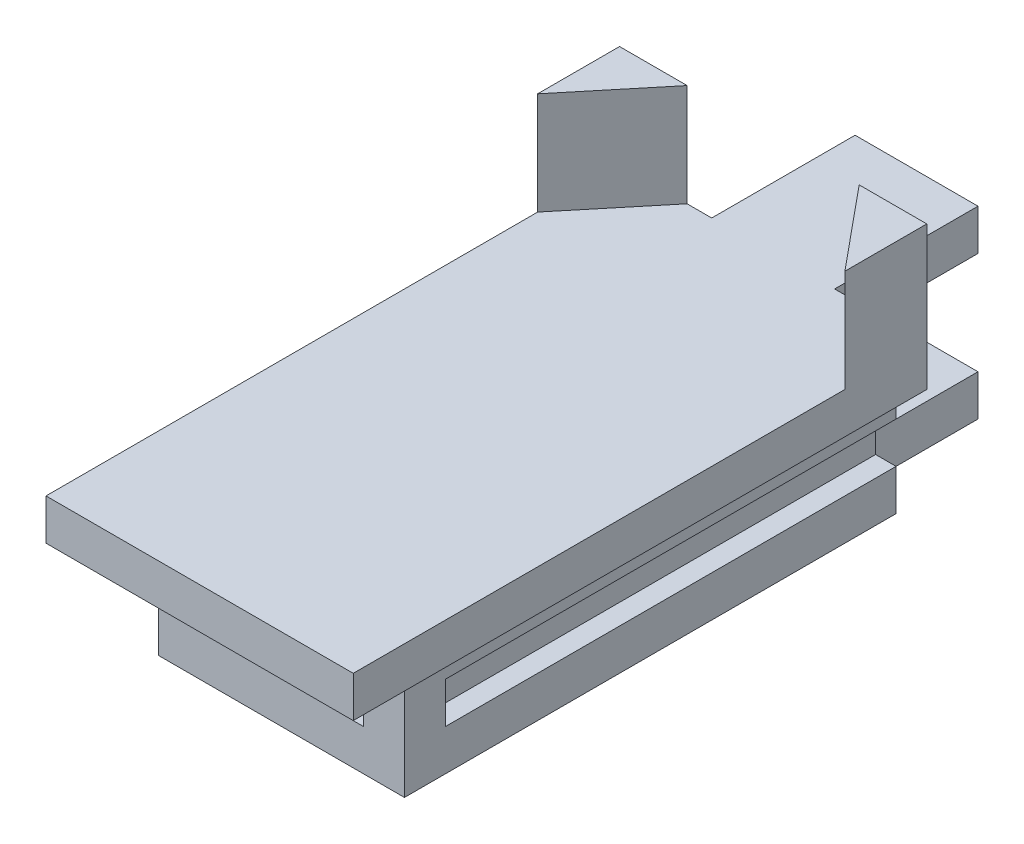
ISO-10303-21;
HEADER;
FILE_DESCRIPTION(('STEP AP214'),'2;1');
FILE_NAME('part.step','',(''),(''),'','','');
FILE_SCHEMA(('AUTOMOTIVE_DESIGN { 1 0 10303 214 1 1 1 1 }'));
ENDSEC;
DATA;
#1=APPLICATION_CONTEXT('core data for automotive mechanical design processes');
#2=APPLICATION_PROTOCOL_DEFINITION('international standard','automotive_design',2000,#1);
#3=PRODUCT_CONTEXT('',#1,'mechanical');
#4=PRODUCT('Part','Part','',(#3));
#5=PRODUCT_RELATED_PRODUCT_CATEGORY('part','',(#4));
#6=PRODUCT_DEFINITION_FORMATION('','',#4);
#7=PRODUCT_DEFINITION_CONTEXT('part definition',#1,'design');
#8=PRODUCT_DEFINITION('design','',#6,#7);
#9=PRODUCT_DEFINITION_SHAPE('','',#8);
#10=(LENGTH_UNIT() NAMED_UNIT(*) SI_UNIT(.MILLI.,.METRE.));
#11=(NAMED_UNIT(*) PLANE_ANGLE_UNIT() SI_UNIT($,.RADIAN.));
#12=(NAMED_UNIT(*) SI_UNIT($,.STERADIAN.) SOLID_ANGLE_UNIT());
#13=UNCERTAINTY_MEASURE_WITH_UNIT(LENGTH_MEASURE(1.E-05),#10,'distance_accuracy_value','');
#14=(GEOMETRIC_REPRESENTATION_CONTEXT(3) GLOBAL_UNCERTAINTY_ASSIGNED_CONTEXT((#13)) GLOBAL_UNIT_ASSIGNED_CONTEXT((#10,
#11,#12)) REPRESENTATION_CONTEXT('',''));
#15=CARTESIAN_POINT('',(0.,0.,0.));
#16=DIRECTION('',(0.,0.,1.));
#17=DIRECTION('',(1.,0.,0.));
#18=AXIS2_PLACEMENT_3D('',#15,#16,#17);
#19=CARTESIAN_POINT('',(-3.75,1.,-5.));
#20=DIRECTION('',(0.,0.,1.));
#21=DIRECTION('',(1.,0.,0.));
#22=AXIS2_PLACEMENT_3D('',#19,#20,#21);
#23=PLANE('',#22);
#24=DIRECTION('',(0.,1.,0.));
#25=VECTOR('',#24,1.);
#26=CARTESIAN_POINT('',(3.,-3.,-5.));
#27=LINE('',#26,#25);
#28=CARTESIAN_POINT('',(3.,-1.,-5.));
#29=VERTEX_POINT('',#28);
#30=CARTESIAN_POINT('',(3.,0.,-5.));
#31=VERTEX_POINT('',#30);
#32=EDGE_CURVE('E441',#29,#31,#27,.T.);
#33=ORIENTED_EDGE('',*,*,#32,.F.);
#34=DIRECTION('',(1.,0.,0.));
#35=VECTOR('',#34,1.);
#36=CARTESIAN_POINT('',(2.5,-1.,-5.));
#37=LINE('',#36,#35);
#38=CARTESIAN_POINT('',(2.5,-1.,-5.));
#39=VERTEX_POINT('',#38);
#40=EDGE_CURVE('E594',#39,#29,#37,.T.);
#41=ORIENTED_EDGE('',*,*,#40,.F.);
#42=DIRECTION('',(0.,1.,0.));
#43=VECTOR('',#42,1.);
#44=CARTESIAN_POINT('',(2.5,0.,-5.));
#45=LINE('',#44,#43);
#46=CARTESIAN_POINT('',(2.5,-2.,-5.));
#47=VERTEX_POINT('',#46);
#48=EDGE_CURVE('E606',#47,#39,#45,.T.);
#49=ORIENTED_EDGE('',*,*,#48,.F.);
#50=DIRECTION('',(1.,0.,0.));
#51=VECTOR('',#50,1.);
#52=CARTESIAN_POINT('',(2.5,-2.,-5.));
#53=LINE('',#52,#51);
#54=CARTESIAN_POINT('',(3.,-2.,-5.));
#55=VERTEX_POINT('',#54);
#56=EDGE_CURVE('E565',#47,#55,#53,.T.);
#57=ORIENTED_EDGE('',*,*,#56,.T.);
#58=CARTESIAN_POINT('',(3.,-3.,-5.));
#59=VERTEX_POINT('',#58);
#60=EDGE_CURVE('E266',#59,#55,#27,.T.);
#61=ORIENTED_EDGE('',*,*,#60,.F.);
#62=DIRECTION('',(-1.,0.,0.));
#63=VECTOR('',#62,1.);
#64=CARTESIAN_POINT('',(0.,-3.,-5.));
#65=LINE('',#64,#63);
#66=CARTESIAN_POINT('',(2.,-3.,-5.));
#67=VERTEX_POINT('',#66);
#68=EDGE_CURVE('E505',#59,#67,#65,.T.);
#69=ORIENTED_EDGE('',*,*,#68,.T.);
#70=DIRECTION('',(0.,-1.,0.));
#71=VECTOR('',#70,1.);
#72=CARTESIAN_POINT('',(2.,-2.,-5.));
#73=LINE('',#72,#71);
#74=CARTESIAN_POINT('',(2.,-2.,-5.));
#75=VERTEX_POINT('',#74);
#76=EDGE_CURVE('E544',#75,#67,#73,.T.);
#77=ORIENTED_EDGE('',*,*,#76,.F.);
#78=DIRECTION('',(0.,1.,0.));
#79=VECTOR('',#78,1.);
#80=CARTESIAN_POINT('',(2.,0.,-5.));
#81=LINE('',#80,#79);
#82=CARTESIAN_POINT('',(2.,0.,-5.));
#83=VERTEX_POINT('',#82);
#84=EDGE_CURVE('E480',#75,#83,#81,.T.);
#85=ORIENTED_EDGE('',*,*,#84,.T.);
#86=DIRECTION('',(1.,0.,0.));
#87=VECTOR('',#86,1.);
#88=CARTESIAN_POINT('',(0.,0.,-5.));
#89=LINE('',#88,#87);
#90=CARTESIAN_POINT('',(1.5,0.,-5.));
#91=VERTEX_POINT('',#90);
#92=EDGE_CURVE('E451',#91,#83,#89,.T.);
#93=ORIENTED_EDGE('',*,*,#92,.F.);
#94=DIRECTION('',(0.,-1.,0.));
#95=VECTOR('',#94,1.);
#96=CARTESIAN_POINT('',(1.5,0.,-5.));
#97=LINE('',#96,#95);
#98=CARTESIAN_POINT('',(1.5,1.,-5.));
#99=VERTEX_POINT('',#98);
#100=EDGE_CURVE('E272',#99,#91,#97,.T.);
#101=ORIENTED_EDGE('',*,*,#100,.F.);
#102=DIRECTION('',(-1.,0.,0.));
#103=VECTOR('',#102,1.);
#104=CARTESIAN_POINT('',(-3.75,1.,-5.));
#105=LINE('',#104,#103);
#106=CARTESIAN_POINT('',(2.1,1.,-5.));
#107=VERTEX_POINT('',#106);
#108=EDGE_CURVE('E339',#107,#99,#105,.T.);
#109=ORIENTED_EDGE('',*,*,#108,.F.);
#110=DIRECTION('',(0.,-1.,0.));
#111=VECTOR('',#110,1.);
#112=CARTESIAN_POINT('',(2.1,3.5,-5.));
#113=LINE('',#112,#111);
#114=CARTESIAN_POINT('',(2.1,3.5,-5.));
#115=VERTEX_POINT('',#114);
#116=EDGE_CURVE('E309',#115,#107,#113,.T.);
#117=ORIENTED_EDGE('',*,*,#116,.F.);
#118=DIRECTION('',(-1.,0.,0.));
#119=VECTOR('',#118,1.);
#120=CARTESIAN_POINT('',(0.,3.5,-5.));
#121=LINE('',#120,#119);
#122=CARTESIAN_POINT('',(3.75,3.5,-5.));
#123=VERTEX_POINT('',#122);
#124=EDGE_CURVE('E296',#123,#115,#121,.T.);
#125=ORIENTED_EDGE('',*,*,#124,.F.);
#126=DIRECTION('',(0.,-1.,0.));
#127=VECTOR('',#126,1.);
#128=CARTESIAN_POINT('',(3.75,1.,-5.));
#129=LINE('',#128,#127);
#130=CARTESIAN_POINT('',(3.75,0.,-5.));
#131=VERTEX_POINT('',#130);
#132=EDGE_CURVE('E11',#123,#131,#129,.T.);
#133=ORIENTED_EDGE('',*,*,#132,.T.);
#134=DIRECTION('',(-1.,0.,0.));
#135=VECTOR('',#134,1.);
#136=CARTESIAN_POINT('',(-3.75,0.,-5.));
#137=LINE('',#136,#135);
#138=EDGE_CURVE('E348',#131,#31,#137,.T.);
#139=ORIENTED_EDGE('',*,*,#138,.T.);
#140=EDGE_LOOP('',(#33,#41,#49,#57,#61,#69,#77,#85,#93,#101,#109,#117,#125,#133,#139));
#141=FACE_BOUND('',#140,.T.);
#142=ADVANCED_FACE('F38',(#141),#23,.F.);
#143=DIRECTION('',(0.,1.,0.));
#144=VECTOR('',#143,1.);
#145=CARTESIAN_POINT('',(-3.,-3.,-5.));
#146=LINE('',#145,#144);
#147=CARTESIAN_POINT('',(-3.,-3.,-5.));
#148=VERTEX_POINT('',#147);
#149=CARTESIAN_POINT('',(-3.,-2.,-5.));
#150=VERTEX_POINT('',#149);
#151=EDGE_CURVE('E462',#148,#150,#146,.T.);
#152=ORIENTED_EDGE('',*,*,#151,.T.);
#153=DIRECTION('',(-1.,0.,0.));
#154=VECTOR('',#153,1.);
#155=CARTESIAN_POINT('',(-2.5,-2.,-5.));
#156=LINE('',#155,#154);
#157=CARTESIAN_POINT('',(-2.5,-2.,-5.));
#158=VERTEX_POINT('',#157);
#159=EDGE_CURVE('E615',#158,#150,#156,.T.);
#160=ORIENTED_EDGE('',*,*,#159,.F.);
#161=DIRECTION('',(0.,-1.,0.));
#162=VECTOR('',#161,1.);
#163=CARTESIAN_POINT('',(-2.5,0.,-5.));
#164=LINE('',#163,#162);
#165=CARTESIAN_POINT('',(-2.5,-1.,-5.));
#166=VERTEX_POINT('',#165);
#167=EDGE_CURVE('E627',#166,#158,#164,.T.);
#168=ORIENTED_EDGE('',*,*,#167,.F.);
#169=DIRECTION('',(-1.,0.,0.));
#170=VECTOR('',#169,1.);
#171=CARTESIAN_POINT('',(-2.5,-1.,-5.));
#172=LINE('',#171,#170);
#173=CARTESIAN_POINT('',(-3.,-1.,-5.));
#174=VERTEX_POINT('',#173);
#175=EDGE_CURVE('E520',#166,#174,#172,.T.);
#176=ORIENTED_EDGE('',*,*,#175,.T.);
#177=CARTESIAN_POINT('',(-3.,0.,-5.));
#178=VERTEX_POINT('',#177);
#179=EDGE_CURVE('E465',#174,#178,#146,.T.);
#180=ORIENTED_EDGE('',*,*,#179,.T.);
#181=CARTESIAN_POINT('',(-3.75,0.,-5.));
#182=VERTEX_POINT('',#181);
#183=EDGE_CURVE('E347',#178,#182,#137,.T.);
#184=ORIENTED_EDGE('',*,*,#183,.T.);
#185=DIRECTION('',(0.,-1.,0.));
#186=VECTOR('',#185,1.);
#187=CARTESIAN_POINT('',(-3.75,1.,-5.));
#188=LINE('',#187,#186);
#189=CARTESIAN_POINT('',(-3.75,3.5,-5.));
#190=VERTEX_POINT('',#189);
#191=EDGE_CURVE('E48',#190,#182,#188,.T.);
#192=ORIENTED_EDGE('',*,*,#191,.F.);
#193=DIRECTION('',(-1.,0.,0.));
#194=VECTOR('',#193,1.);
#195=CARTESIAN_POINT('',(0.,3.5,-5.));
#196=LINE('',#195,#194);
#197=CARTESIAN_POINT('',(-2.1,3.5,-5.));
#198=VERTEX_POINT('',#197);
#199=EDGE_CURVE('E316',#198,#190,#196,.T.);
#200=ORIENTED_EDGE('',*,*,#199,.F.);
#201=DIRECTION('',(0.,-1.,0.));
#202=VECTOR('',#201,1.);
#203=CARTESIAN_POINT('',(-2.1,3.5,-5.));
#204=LINE('',#203,#202);
#205=CARTESIAN_POINT('',(-2.1,1.,-5.));
#206=VERTEX_POINT('',#205);
#207=EDGE_CURVE('E332',#198,#206,#204,.T.);
#208=ORIENTED_EDGE('',*,*,#207,.T.);
#209=CARTESIAN_POINT('',(-1.5,1.,-5.));
#210=VERTEX_POINT('',#209);
#211=EDGE_CURVE('E42',#210,#206,#105,.T.);
#212=ORIENTED_EDGE('',*,*,#211,.F.);
#213=DIRECTION('',(0.,1.,0.));
#214=VECTOR('',#213,1.);
#215=CARTESIAN_POINT('',(-1.5,0.,-5.));
#216=LINE('',#215,#214);
#217=CARTESIAN_POINT('',(-1.5,0.,-5.));
#218=VERTEX_POINT('',#217);
#219=EDGE_CURVE('E277',#218,#210,#216,.T.);
#220=ORIENTED_EDGE('',*,*,#219,.F.);
#221=CARTESIAN_POINT('',(-2.,0.,-5.));
#222=VERTEX_POINT('',#221);
#223=EDGE_CURVE('E270',#222,#218,#89,.T.);
#224=ORIENTED_EDGE('',*,*,#223,.F.);
#225=DIRECTION('',(0.,1.,0.));
#226=VECTOR('',#225,1.);
#227=CARTESIAN_POINT('',(-2.,0.,-5.));
#228=LINE('',#227,#226);
#229=CARTESIAN_POINT('',(-2.,-2.,-5.));
#230=VERTEX_POINT('',#229);
#231=EDGE_CURVE('E474',#230,#222,#228,.T.);
#232=ORIENTED_EDGE('',*,*,#231,.F.);
#233=DIRECTION('',(0.,1.,0.));
#234=VECTOR('',#233,1.);
#235=CARTESIAN_POINT('',(-2.,-2.,-5.));
#236=LINE('',#235,#234);
#237=CARTESIAN_POINT('',(-2.,-3.,-5.));
#238=VERTEX_POINT('',#237);
#239=EDGE_CURVE('E476',#238,#230,#236,.T.);
#240=ORIENTED_EDGE('',*,*,#239,.F.);
#241=EDGE_CURVE('E461',#238,#148,#65,.T.);
#242=ORIENTED_EDGE('',*,*,#241,.T.);
#243=EDGE_LOOP('',(#152,#160,#168,#176,#180,#184,#192,#200,#208,#212,#220,#224,#232,#240,#242));
#244=FACE_BOUND('',#243,.T.);
#245=ADVANCED_FACE('F378',(#244),#23,.F.);
#246=CARTESIAN_POINT('',(0.,-3.,7.));
#247=DIRECTION('',(0.,0.,1.));
#248=DIRECTION('',(1.,0.,0.));
#249=AXIS2_PLACEMENT_3D('',#246,#247,#248);
#250=PLANE('',#249);
#251=DIRECTION('',(1.,0.,0.));
#252=VECTOR('',#251,1.);
#253=CARTESIAN_POINT('',(0.,0.,7.));
#254=LINE('',#253,#252);
#255=CARTESIAN_POINT('',(2.,0.,7.));
#256=VERTEX_POINT('',#255);
#257=CARTESIAN_POINT('',(3.,0.,7.));
#258=VERTEX_POINT('',#257);
#259=EDGE_CURVE('E446',#256,#258,#254,.T.);
#260=ORIENTED_EDGE('',*,*,#259,.F.);
#261=DIRECTION('',(0.,-1.,0.));
#262=VECTOR('',#261,1.);
#263=CARTESIAN_POINT('',(2.,0.,7.));
#264=LINE('',#263,#262);
#265=CARTESIAN_POINT('',(2.,-2.,7.));
#266=VERTEX_POINT('',#265);
#267=EDGE_CURVE('E491',#256,#266,#264,.T.);
#268=ORIENTED_EDGE('',*,*,#267,.T.);
#269=DIRECTION('',(1.,0.,0.));
#270=VECTOR('',#269,1.);
#271=CARTESIAN_POINT('',(0.,-2.,7.));
#272=LINE('',#271,#270);
#273=CARTESIAN_POINT('',(-2.,-2.,7.));
#274=VERTEX_POINT('',#273);
#275=EDGE_CURVE('E497',#274,#266,#272,.T.);
#276=ORIENTED_EDGE('',*,*,#275,.F.);
#277=DIRECTION('',(0.,-1.,0.));
#278=VECTOR('',#277,1.);
#279=CARTESIAN_POINT('',(-2.,0.,7.));
#280=LINE('',#279,#278);
#281=CARTESIAN_POINT('',(-2.,0.,7.));
#282=VERTEX_POINT('',#281);
#283=EDGE_CURVE('E494',#282,#274,#280,.T.);
#284=ORIENTED_EDGE('',*,*,#283,.F.);
#285=CARTESIAN_POINT('',(-3.,0.,7.));
#286=VERTEX_POINT('',#285);
#287=EDGE_CURVE('E449',#286,#282,#254,.T.);
#288=ORIENTED_EDGE('',*,*,#287,.F.);
#289=DIRECTION('',(0.,1.,0.));
#290=VECTOR('',#289,1.);
#291=CARTESIAN_POINT('',(-3.,-3.,7.));
#292=LINE('',#291,#290);
#293=CARTESIAN_POINT('',(-3.,-3.,7.));
#294=VERTEX_POINT('',#293);
#295=EDGE_CURVE('E464',#294,#286,#292,.T.);
#296=ORIENTED_EDGE('',*,*,#295,.F.);
#297=DIRECTION('',(1.,0.,0.));
#298=VECTOR('',#297,1.);
#299=CARTESIAN_POINT('',(0.,-3.,7.));
#300=LINE('',#299,#298);
#301=CARTESIAN_POINT('',(3.,-3.,7.));
#302=VERTEX_POINT('',#301);
#303=EDGE_CURVE('E510',#294,#302,#300,.T.);
#304=ORIENTED_EDGE('',*,*,#303,.T.);
#305=DIRECTION('',(0.,1.,0.));
#306=VECTOR('',#305,1.);
#307=CARTESIAN_POINT('',(3.,-3.,7.));
#308=LINE('',#307,#306);
#309=EDGE_CURVE('E467',#302,#258,#308,.T.);
#310=ORIENTED_EDGE('',*,*,#309,.T.);
#311=EDGE_LOOP('',(#260,#268,#276,#284,#288,#296,#304,#310));
#312=FACE_BOUND('',#311,.T.);
#313=ADVANCED_FACE('F400',(#312),#250,.T.);
#314=CARTESIAN_POINT('',(0.,1.,0.));
#315=DIRECTION('',(0.,-1.,0.));
#316=DIRECTION('',(0.,0.,-1.));
#317=AXIS2_PLACEMENT_3D('',#314,#315,#316);
#318=PLANE('',#317);
#319=DIRECTION('',(0.,0.,1.));
#320=VECTOR('',#319,1.);
#321=CARTESIAN_POINT('',(1.5,1.,-10.));
#322=LINE('',#321,#320);
#323=CARTESIAN_POINT('',(1.5,1.,-8.5));
#324=VERTEX_POINT('',#323);
#325=EDGE_CURVE('E274',#324,#99,#322,.T.);
#326=ORIENTED_EDGE('',*,*,#325,.F.);
#327=DIRECTION('',(-1.,0.,0.));
#328=VECTOR('',#327,1.);
#329=CARTESIAN_POINT('',(0.,1.,-8.5));
#330=LINE('',#329,#328);
#331=CARTESIAN_POINT('',(-1.5,1.,-8.5));
#332=VERTEX_POINT('',#331);
#333=EDGE_CURVE('E256',#324,#332,#330,.T.);
#334=ORIENTED_EDGE('',*,*,#333,.T.);
#335=DIRECTION('',(0.,0.,1.));
#336=VECTOR('',#335,1.);
#337=CARTESIAN_POINT('',(-1.5,1.,-10.));
#338=LINE('',#337,#336);
#339=EDGE_CURVE('E265',#332,#210,#338,.T.);
#340=ORIENTED_EDGE('',*,*,#339,.T.);
#341=ORIENTED_EDGE('',*,*,#211,.T.);
#342=DIRECTION('',(-0.636382954795564,0.,0.771373278540077));
#343=VECTOR('',#342,1.);
#344=CARTESIAN_POINT('',(-3.70397917441428,1.,-3.05578281889178));
#345=LINE('',#344,#343);
#346=CARTESIAN_POINT('',(-3.75,1.,-2.99999999999999));
#347=VERTEX_POINT('',#346);
#348=EDGE_CURVE('E312',#206,#347,#345,.T.);
#349=ORIENTED_EDGE('',*,*,#348,.T.);
#350=DIRECTION('',(0.,0.,1.));
#351=VECTOR('',#350,1.);
#352=CARTESIAN_POINT('',(-3.75,1.,5.));
#353=LINE('',#352,#351);
#354=CARTESIAN_POINT('',(-3.75,1.,9.));
#355=VERTEX_POINT('',#354);
#356=EDGE_CURVE('E329',#347,#355,#353,.T.);
#357=ORIENTED_EDGE('',*,*,#356,.T.);
#358=DIRECTION('',(-1.,0.,0.));
#359=VECTOR('',#358,1.);
#360=CARTESIAN_POINT('',(-3.75,1.,9.));
#361=LINE('',#360,#359);
#362=CARTESIAN_POINT('',(3.75,1.,9.));
#363=VERTEX_POINT('',#362);
#364=EDGE_CURVE('E292',#363,#355,#361,.T.);
#365=ORIENTED_EDGE('',*,*,#364,.F.);
#366=DIRECTION('',(0.,0.,-1.));
#367=VECTOR('',#366,1.);
#368=CARTESIAN_POINT('',(3.75,1.,5.));
#369=LINE('',#368,#367);
#370=CARTESIAN_POINT('',(3.75,1.,-3.));
#371=VERTEX_POINT('',#370);
#372=EDGE_CURVE('E324',#363,#371,#369,.T.);
#373=ORIENTED_EDGE('',*,*,#372,.T.);
#374=DIRECTION('',(0.636382954795564,0.,0.771373278540077));
#375=VECTOR('',#374,1.);
#376=CARTESIAN_POINT('',(3.70397917441428,1.,-3.05578281889178));
#377=LINE('',#376,#375);
#378=EDGE_CURVE('E295',#107,#371,#377,.T.);
#379=ORIENTED_EDGE('',*,*,#378,.F.);
#380=ORIENTED_EDGE('',*,*,#108,.T.);
#381=EDGE_LOOP('',(#326,#334,#340,#341,#349,#357,#365,#373,#379,#380));
#382=FACE_BOUND('',#381,.T.);
#383=ADVANCED_FACE('F361',(#382),#318,.F.);
#384=CARTESIAN_POINT('',(-1.5,0.,-10.));
#385=DIRECTION('',(1.,0.,0.));
#386=DIRECTION('',(0.,1.,0.));
#387=AXIS2_PLACEMENT_3D('',#384,#385,#386);
#388=PLANE('',#387);
#389=DIRECTION('',(0.,1.,0.));
#390=VECTOR('',#389,1.);
#391=CARTESIAN_POINT('',(-1.5,0.,-8.5));
#392=LINE('',#391,#390);
#393=CARTESIAN_POINT('',(-1.5,0.,-8.5));
#394=VERTEX_POINT('',#393);
#395=EDGE_CURVE('E248',#394,#332,#392,.T.);
#396=ORIENTED_EDGE('',*,*,#395,.F.);
#397=DIRECTION('',(0.,0.,1.));
#398=VECTOR('',#397,1.);
#399=CARTESIAN_POINT('',(-1.5,0.,-10.));
#400=LINE('',#399,#398);
#401=EDGE_CURVE('E263',#394,#218,#400,.T.);
#402=ORIENTED_EDGE('',*,*,#401,.T.);
#403=ORIENTED_EDGE('',*,*,#219,.T.);
#404=ORIENTED_EDGE('',*,*,#339,.F.);
#405=EDGE_LOOP('',(#396,#402,#403,#404));
#406=FACE_BOUND('',#405,.T.);
#407=ADVANCED_FACE('F261',(#406),#388,.F.);
#408=CARTESIAN_POINT('',(1.5,0.,-10.));
#409=DIRECTION('',(-1.,0.,0.));
#410=DIRECTION('',(0.,-1.,0.));
#411=AXIS2_PLACEMENT_3D('',#408,#409,#410);
#412=PLANE('',#411);
#413=DIRECTION('',(0.,-1.,0.));
#414=VECTOR('',#413,1.);
#415=CARTESIAN_POINT('',(1.5,0.,-8.5));
#416=LINE('',#415,#414);
#417=CARTESIAN_POINT('',(1.5,0.,-8.5));
#418=VERTEX_POINT('',#417);
#419=EDGE_CURVE('E251',#324,#418,#416,.T.);
#420=ORIENTED_EDGE('',*,*,#419,.F.);
#421=ORIENTED_EDGE('',*,*,#325,.T.);
#422=ORIENTED_EDGE('',*,*,#100,.T.);
#423=DIRECTION('',(0.,0.,1.));
#424=VECTOR('',#423,1.);
#425=CARTESIAN_POINT('',(1.5,0.,-10.));
#426=LINE('',#425,#424);
#427=EDGE_CURVE('E271',#418,#91,#426,.T.);
#428=ORIENTED_EDGE('',*,*,#427,.F.);
#429=EDGE_LOOP('',(#420,#421,#422,#428));
#430=FACE_BOUND('',#429,.T.);
#431=ADVANCED_FACE('F412',(#430),#412,.F.);
#432=CARTESIAN_POINT('',(3.75,1.,5.));
#433=DIRECTION('',(-1.,0.,0.));
#434=DIRECTION('',(0.,0.,1.));
#435=AXIS2_PLACEMENT_3D('',#432,#433,#434);
#436=PLANE('',#435);
#437=DIRECTION('',(0.,0.,-1.));
#438=VECTOR('',#437,1.);
#439=CARTESIAN_POINT('',(3.75,0.,5.));
#440=LINE('',#439,#438);
#441=CARTESIAN_POINT('',(3.75,0.,9.));
#442=VERTEX_POINT('',#441);
#443=EDGE_CURVE('E337',#442,#131,#440,.T.);
#444=ORIENTED_EDGE('',*,*,#443,.T.);
#445=ORIENTED_EDGE('',*,*,#132,.F.);
#446=DIRECTION('',(0.,0.,-1.));
#447=VECTOR('',#446,1.);
#448=CARTESIAN_POINT('',(3.75,3.5,0.));
#449=LINE('',#448,#447);
#450=CARTESIAN_POINT('',(3.75,3.5,-3.));
#451=VERTEX_POINT('',#450);
#452=EDGE_CURVE('E301',#451,#123,#449,.T.);
#453=ORIENTED_EDGE('',*,*,#452,.F.);
#454=DIRECTION('',(0.,-1.,0.));
#455=VECTOR('',#454,1.);
#456=CARTESIAN_POINT('',(3.75,3.5,-3.));
#457=LINE('',#456,#455);
#458=EDGE_CURVE('E304',#451,#371,#457,.T.);
#459=ORIENTED_EDGE('',*,*,#458,.T.);
#460=ORIENTED_EDGE('',*,*,#372,.F.);
#461=DIRECTION('',(0.,1.,0.));
#462=VECTOR('',#461,1.);
#463=CARTESIAN_POINT('',(3.75,1.,9.));
#464=LINE('',#463,#462);
#465=EDGE_CURVE('E289',#442,#363,#464,.T.);
#466=ORIENTED_EDGE('',*,*,#465,.F.);
#467=EDGE_LOOP('',(#444,#445,#453,#459,#460,#466));
#468=FACE_BOUND('',#467,.T.);
#469=ADVANCED_FACE('F40',(#468),#436,.F.);
#470=CARTESIAN_POINT('',(-3.75,1.,5.));
#471=DIRECTION('',(1.,0.,0.));
#472=DIRECTION('',(0.,0.,-1.));
#473=AXIS2_PLACEMENT_3D('',#470,#471,#472);
#474=PLANE('',#473);
#475=DIRECTION('',(0.,0.,1.));
#476=VECTOR('',#475,1.);
#477=CARTESIAN_POINT('',(-3.75,0.,5.));
#478=LINE('',#477,#476);
#479=CARTESIAN_POINT('',(-3.75,0.,9.));
#480=VERTEX_POINT('',#479);
#481=EDGE_CURVE('E351',#182,#480,#478,.T.);
#482=ORIENTED_EDGE('',*,*,#481,.T.);
#483=DIRECTION('',(0.,-1.,0.));
#484=VECTOR('',#483,1.);
#485=CARTESIAN_POINT('',(-3.75,1.,9.));
#486=LINE('',#485,#484);
#487=EDGE_CURVE('E283',#355,#480,#486,.T.);
#488=ORIENTED_EDGE('',*,*,#487,.F.);
#489=ORIENTED_EDGE('',*,*,#356,.F.);
#490=DIRECTION('',(0.,-1.,0.));
#491=VECTOR('',#490,1.);
#492=CARTESIAN_POINT('',(-3.75,3.5,-3.));
#493=LINE('',#492,#491);
#494=CARTESIAN_POINT('',(-3.75,3.5,-3.));
#495=VERTEX_POINT('',#494);
#496=EDGE_CURVE('E321',#495,#347,#493,.T.);
#497=ORIENTED_EDGE('',*,*,#496,.F.);
#498=DIRECTION('',(0.,0.,1.));
#499=VECTOR('',#498,1.);
#500=CARTESIAN_POINT('',(-3.75,3.5,0.));
#501=LINE('',#500,#499);
#502=EDGE_CURVE('E319',#190,#495,#501,.T.);
#503=ORIENTED_EDGE('',*,*,#502,.F.);
#504=ORIENTED_EDGE('',*,*,#191,.T.);
#505=EDGE_LOOP('',(#482,#488,#489,#497,#503,#504));
#506=FACE_BOUND('',#505,.T.);
#507=ADVANCED_FACE('F368',(#506),#474,.F.);
#508=CARTESIAN_POINT('',(0.,0.,0.));
#509=DIRECTION('',(0.,-1.,0.));
#510=DIRECTION('',(0.,0.,-1.));
#511=AXIS2_PLACEMENT_3D('',#508,#509,#510);
#512=PLANE('',#511);
#513=DIRECTION('',(-1.,0.,0.));
#514=VECTOR('',#513,1.);
#515=CARTESIAN_POINT('',(-3.5,0.,-8.5));
#516=LINE('',#515,#514);
#517=EDGE_CURVE('E245',#418,#394,#516,.T.);
#518=ORIENTED_EDGE('',*,*,#517,.F.);
#519=ORIENTED_EDGE('',*,*,#427,.T.);
#520=ORIENTED_EDGE('',*,*,#92,.T.);
#521=DIRECTION('',(0.,0.,1.));
#522=VECTOR('',#521,1.);
#523=CARTESIAN_POINT('',(2.,0.,-9.47213595499958));
#524=LINE('',#523,#522);
#525=EDGE_CURVE('E499',#83,#256,#524,.T.);
#526=ORIENTED_EDGE('',*,*,#525,.T.);
#527=ORIENTED_EDGE('',*,*,#259,.T.);
#528=DIRECTION('',(0.,0.,-1.));
#529=VECTOR('',#528,1.);
#530=CARTESIAN_POINT('',(3.,0.,0.));
#531=LINE('',#530,#529);
#532=EDGE_CURVE('E444',#258,#31,#531,.T.);
#533=ORIENTED_EDGE('',*,*,#532,.T.);
#534=ORIENTED_EDGE('',*,*,#138,.F.);
#535=ORIENTED_EDGE('',*,*,#443,.F.);
#536=DIRECTION('',(1.,0.,0.));
#537=VECTOR('',#536,1.);
#538=CARTESIAN_POINT('',(-3.75,0.,9.));
#539=LINE('',#538,#537);
#540=EDGE_CURVE('E286',#480,#442,#539,.T.);
#541=ORIENTED_EDGE('',*,*,#540,.F.);
#542=ORIENTED_EDGE('',*,*,#481,.F.);
#543=ORIENTED_EDGE('',*,*,#183,.F.);
#544=DIRECTION('',(0.,0.,-1.));
#545=VECTOR('',#544,1.);
#546=CARTESIAN_POINT('',(-3.,0.,0.));
#547=LINE('',#546,#545);
#548=EDGE_CURVE('E458',#286,#178,#547,.T.);
#549=ORIENTED_EDGE('',*,*,#548,.F.);
#550=ORIENTED_EDGE('',*,*,#287,.T.);
#551=DIRECTION('',(0.,0.,1.));
#552=VECTOR('',#551,1.);
#553=CARTESIAN_POINT('',(-2.,0.,-9.47213595499958));
#554=LINE('',#553,#552);
#555=EDGE_CURVE('E502',#222,#282,#554,.T.);
#556=ORIENTED_EDGE('',*,*,#555,.F.);
#557=ORIENTED_EDGE('',*,*,#223,.T.);
#558=ORIENTED_EDGE('',*,*,#401,.F.);
#559=EDGE_LOOP('',(#518,#519,#520,#526,#527,#533,#534,#535,#541,#542,#543,#549,#550,#556,#557,#558));
#560=FACE_BOUND('',#559,.T.);
#561=ADVANCED_FACE('F268',(#560),#512,.T.);
#562=CARTESIAN_POINT('',(-3.70397917441428,3.5,-3.05578281889178));
#563=DIRECTION('',(0.771373278540077,0.,0.636382954795564));
#564=DIRECTION('',(0.636382954795564,0.,-0.771373278540077));
#565=AXIS2_PLACEMENT_3D('',#562,#563,#564);
#566=PLANE('',#565);
#567=ORIENTED_EDGE('',*,*,#348,.F.);
#568=ORIENTED_EDGE('',*,*,#207,.F.);
#569=DIRECTION('',(-0.636382954795564,0.,0.771373278540077));
#570=VECTOR('',#569,1.);
#571=CARTESIAN_POINT('',(-3.70397917441428,3.5,-3.05578281889178));
#572=LINE('',#571,#570);
#573=EDGE_CURVE('E313',#198,#495,#572,.T.);
#574=ORIENTED_EDGE('',*,*,#573,.T.);
#575=ORIENTED_EDGE('',*,*,#496,.T.);
#576=EDGE_LOOP('',(#567,#568,#574,#575));
#577=FACE_BOUND('',#576,.T.);
#578=ADVANCED_FACE('F381',(#577),#566,.T.);
#579=CARTESIAN_POINT('',(0.,3.5,0.));
#580=DIRECTION('',(0.,1.,0.));
#581=DIRECTION('',(0.,0.,1.));
#582=AXIS2_PLACEMENT_3D('',#579,#580,#581);
#583=PLANE('',#582);
#584=ORIENTED_EDGE('',*,*,#573,.F.);
#585=ORIENTED_EDGE('',*,*,#199,.T.);
#586=ORIENTED_EDGE('',*,*,#502,.T.);
#587=EDGE_LOOP('',(#584,#585,#586));
#588=FACE_BOUND('',#587,.T.);
#589=ADVANCED_FACE('F383',(#588),#583,.T.);
#590=CARTESIAN_POINT('',(3.70397917441428,3.5,-3.05578281889178));
#591=DIRECTION('',(0.771373278540077,0.,-0.636382954795564));
#592=DIRECTION('',(-0.636382954795564,0.,-0.771373278540077));
#593=AXIS2_PLACEMENT_3D('',#590,#591,#592);
#594=PLANE('',#593);
#595=ORIENTED_EDGE('',*,*,#378,.T.);
#596=ORIENTED_EDGE('',*,*,#458,.F.);
#597=DIRECTION('',(0.636382954795564,0.,0.771373278540077));
#598=VECTOR('',#597,1.);
#599=CARTESIAN_POINT('',(3.70397917441428,3.5,-3.05578281889178));
#600=LINE('',#599,#598);
#601=EDGE_CURVE('E299',#115,#451,#600,.T.);
#602=ORIENTED_EDGE('',*,*,#601,.F.);
#603=ORIENTED_EDGE('',*,*,#116,.T.);
#604=EDGE_LOOP('',(#595,#596,#602,#603));
#605=FACE_BOUND('',#604,.T.);
#606=ADVANCED_FACE('F385',(#605),#594,.F.);
#607=CARTESIAN_POINT('',(0.,3.5,0.));
#608=DIRECTION('',(0.,1.,0.));
#609=DIRECTION('',(0.,0.,1.));
#610=AXIS2_PLACEMENT_3D('',#607,#608,#609);
#611=PLANE('',#610);
#612=ORIENTED_EDGE('',*,*,#124,.T.);
#613=ORIENTED_EDGE('',*,*,#601,.T.);
#614=ORIENTED_EDGE('',*,*,#452,.T.);
#615=EDGE_LOOP('',(#612,#613,#614));
#616=FACE_BOUND('',#615,.T.);
#617=ADVANCED_FACE('F391',(#616),#611,.T.);
#618=CARTESIAN_POINT('',(0.,0.,9.));
#619=DIRECTION('',(0.,0.,1.));
#620=DIRECTION('',(1.,0.,0.));
#621=AXIS2_PLACEMENT_3D('',#618,#619,#620);
#622=PLANE('',#621);
#623=ORIENTED_EDGE('',*,*,#487,.T.);
#624=ORIENTED_EDGE('',*,*,#540,.T.);
#625=ORIENTED_EDGE('',*,*,#465,.T.);
#626=ORIENTED_EDGE('',*,*,#364,.T.);
#627=EDGE_LOOP('',(#623,#624,#625,#626));
#628=FACE_BOUND('',#627,.T.);
#629=ADVANCED_FACE('F366',(#628),#622,.T.);
#630=CARTESIAN_POINT('',(3.,-3.,0.));
#631=DIRECTION('',(1.,0.,0.));
#632=DIRECTION('',(0.,0.,-1.));
#633=AXIS2_PLACEMENT_3D('',#630,#631,#632);
#634=PLANE('',#633);
#635=DIRECTION('',(0.,0.,1.));
#636=VECTOR('',#635,1.);
#637=CARTESIAN_POINT('',(3.,-1.,0.));
#638=LINE('',#637,#636);
#639=CARTESIAN_POINT('',(3.,-1.,6.));
#640=VERTEX_POINT('',#639);
#641=EDGE_CURVE('E597',#29,#640,#638,.T.);
#642=ORIENTED_EDGE('',*,*,#641,.F.);
#643=ORIENTED_EDGE('',*,*,#32,.T.);
#644=ORIENTED_EDGE('',*,*,#532,.F.);
#645=ORIENTED_EDGE('',*,*,#309,.F.);
#646=DIRECTION('',(0.,0.,-1.));
#647=VECTOR('',#646,1.);
#648=CARTESIAN_POINT('',(3.,-3.,0.));
#649=LINE('',#648,#647);
#650=EDGE_CURVE('E508',#302,#59,#649,.T.);
#651=ORIENTED_EDGE('',*,*,#650,.T.);
#652=ORIENTED_EDGE('',*,*,#60,.T.);
#653=DIRECTION('',(0.,0.,1.));
#654=VECTOR('',#653,1.);
#655=CARTESIAN_POINT('',(3.,-2.,0.));
#656=LINE('',#655,#654);
#657=CARTESIAN_POINT('',(3.,-2.,6.));
#658=VERTEX_POINT('',#657);
#659=EDGE_CURVE('E568',#55,#658,#656,.T.);
#660=ORIENTED_EDGE('',*,*,#659,.T.);
#661=DIRECTION('',(0.,1.,0.));
#662=VECTOR('',#661,1.);
#663=CARTESIAN_POINT('',(3.,0.,6.));
#664=LINE('',#663,#662);
#665=EDGE_CURVE('E64',#658,#640,#664,.T.);
#666=ORIENTED_EDGE('',*,*,#665,.T.);
#667=EDGE_LOOP('',(#642,#643,#644,#645,#651,#652,#660,#666));
#668=FACE_BOUND('',#667,.T.);
#669=ADVANCED_FACE('F423',(#668),#634,.T.);
#670=CARTESIAN_POINT('',(-3.,-3.,0.));
#671=DIRECTION('',(1.,0.,0.));
#672=DIRECTION('',(0.,0.,-1.));
#673=AXIS2_PLACEMENT_3D('',#670,#671,#672);
#674=PLANE('',#673);
#675=DIRECTION('',(0.,-1.,0.));
#676=VECTOR('',#675,1.);
#677=CARTESIAN_POINT('',(-3.,0.,6.));
#678=LINE('',#677,#676);
#679=CARTESIAN_POINT('',(-3.,-1.,6.));
#680=VERTEX_POINT('',#679);
#681=CARTESIAN_POINT('',(-3.,-2.,6.));
#682=VERTEX_POINT('',#681);
#683=EDGE_CURVE('E56',#680,#682,#678,.T.);
#684=ORIENTED_EDGE('',*,*,#683,.T.);
#685=DIRECTION('',(0.,0.,1.));
#686=VECTOR('',#685,1.);
#687=CARTESIAN_POINT('',(-3.,-2.,0.));
#688=LINE('',#687,#686);
#689=EDGE_CURVE('E618',#150,#682,#688,.T.);
#690=ORIENTED_EDGE('',*,*,#689,.F.);
#691=ORIENTED_EDGE('',*,*,#151,.F.);
#692=DIRECTION('',(0.,0.,-1.));
#693=VECTOR('',#692,1.);
#694=CARTESIAN_POINT('',(-3.,-3.,0.));
#695=LINE('',#694,#693);
#696=EDGE_CURVE('E454',#294,#148,#695,.T.);
#697=ORIENTED_EDGE('',*,*,#696,.F.);
#698=ORIENTED_EDGE('',*,*,#295,.T.);
#699=ORIENTED_EDGE('',*,*,#548,.T.);
#700=ORIENTED_EDGE('',*,*,#179,.F.);
#701=DIRECTION('',(0.,0.,1.));
#702=VECTOR('',#701,1.);
#703=CARTESIAN_POINT('',(-3.,-1.,0.));
#704=LINE('',#703,#702);
#705=EDGE_CURVE('E622',#174,#680,#704,.T.);
#706=ORIENTED_EDGE('',*,*,#705,.T.);
#707=EDGE_LOOP('',(#684,#690,#691,#697,#698,#699,#700,#706));
#708=FACE_BOUND('',#707,.T.);
#709=ADVANCED_FACE('F421',(#708),#674,.F.);
#710=CARTESIAN_POINT('',(0.,-3.,0.));
#711=DIRECTION('',(0.,-1.,0.));
#712=DIRECTION('',(0.,0.,-1.));
#713=AXIS2_PLACEMENT_3D('',#710,#711,#712);
#714=PLANE('',#713);
#715=CARTESIAN_POINT('',(0.,-3.,-5.));
#716=DIRECTION('',(0.,-1.,0.));
#717=DIRECTION('',(0.,0.,-1.));
#718=AXIS2_PLACEMENT_3D('',#715,#716,#717);
#719=CIRCLE('',#718,1.);
#720=CARTESIAN_POINT('',(0.,-3.,-6.));
#721=VERTEX_POINT('',#720);
#722=EDGE_CURVE('E586',#721,#721,#719,.T.);
#723=ORIENTED_EDGE('',*,*,#722,.F.);
#724=EDGE_LOOP('',(#723));
#725=FACE_BOUND('',#724,.T.);
#726=CARTESIAN_POINT('',(0.,-3.,5.));
#727=DIRECTION('',(0.,-1.,0.));
#728=DIRECTION('',(0.,0.,-1.));
#729=AXIS2_PLACEMENT_3D('',#726,#727,#728);
#730=CIRCLE('',#729,1.);
#731=CARTESIAN_POINT('',(0.,-3.,4.));
#732=VERTEX_POINT('',#731);
#733=EDGE_CURVE('E580',#732,#732,#730,.T.);
#734=ORIENTED_EDGE('',*,*,#733,.F.);
#735=EDGE_LOOP('',(#734));
#736=FACE_BOUND('',#735,.T.);
#737=ORIENTED_EDGE('',*,*,#68,.F.);
#738=ORIENTED_EDGE('',*,*,#650,.F.);
#739=ORIENTED_EDGE('',*,*,#303,.F.);
#740=ORIENTED_EDGE('',*,*,#696,.T.);
#741=ORIENTED_EDGE('',*,*,#241,.F.);
#742=DIRECTION('',(0.,0.,1.));
#743=VECTOR('',#742,1.);
#744=CARTESIAN_POINT('',(-2.,-3.,-8.));
#745=LINE('',#744,#743);
#746=CARTESIAN_POINT('',(-2.,-3.,-8.));
#747=VERTEX_POINT('',#746);
#748=EDGE_CURVE('E538',#747,#238,#745,.T.);
#749=ORIENTED_EDGE('',*,*,#748,.F.);
#750=DIRECTION('',(-1.,0.,0.));
#751=VECTOR('',#750,1.);
#752=CARTESIAN_POINT('',(2.,-3.,-8.));
#753=LINE('',#752,#751);
#754=CARTESIAN_POINT('',(2.,-3.,-8.));
#755=VERTEX_POINT('',#754);
#756=EDGE_CURVE('E547',#755,#747,#753,.T.);
#757=ORIENTED_EDGE('',*,*,#756,.F.);
#758=DIRECTION('',(0.,0.,1.));
#759=VECTOR('',#758,1.);
#760=CARTESIAN_POINT('',(2.,-3.,-8.));
#761=LINE('',#760,#759);
#762=EDGE_CURVE('E488',#755,#67,#761,.T.);
#763=ORIENTED_EDGE('',*,*,#762,.T.);
#764=EDGE_LOOP('',(#737,#738,#739,#740,#741,#749,#757,#763));
#765=FACE_BOUND('',#764,.T.);
#766=ADVANCED_FACE('F556',(#725,#736,#765),#714,.T.);
#767=CARTESIAN_POINT('',(2.,0.,-9.47213595499958));
#768=DIRECTION('',(-1.,0.,0.));
#769=DIRECTION('',(0.,-1.,0.));
#770=AXIS2_PLACEMENT_3D('',#767,#768,#769);
#771=PLANE('',#770);
#772=DIRECTION('',(0.,0.,1.));
#773=VECTOR('',#772,1.);
#774=CARTESIAN_POINT('',(2.,-2.,-9.47213595499958));
#775=LINE('',#774,#773);
#776=EDGE_CURVE('E481',#75,#266,#775,.T.);
#777=ORIENTED_EDGE('',*,*,#776,.T.);
#778=ORIENTED_EDGE('',*,*,#267,.F.);
#779=ORIENTED_EDGE('',*,*,#525,.F.);
#780=ORIENTED_EDGE('',*,*,#84,.F.);
#781=EDGE_LOOP('',(#777,#778,#779,#780));
#782=FACE_BOUND('',#781,.T.);
#783=ADVANCED_FACE('F571',(#782),#771,.T.);
#784=CARTESIAN_POINT('',(0.,-2.,-9.47213595499958));
#785=DIRECTION('',(0.,-1.,0.));
#786=DIRECTION('',(1.,0.,0.));
#787=AXIS2_PLACEMENT_3D('',#784,#785,#786);
#788=PLANE('',#787);
#789=CARTESIAN_POINT('',(0.,-2.,-5.));
#790=DIRECTION('',(0.,-1.,0.));
#791=DIRECTION('',(1.,0.,0.));
#792=AXIS2_PLACEMENT_3D('',#789,#790,#791);
#793=CIRCLE('',#792,1.);
#794=CARTESIAN_POINT('',(1.,-2.,-5.));
#795=VERTEX_POINT('',#794);
#796=EDGE_CURVE('E583',#795,#795,#793,.F.);
#797=ORIENTED_EDGE('',*,*,#796,.F.);
#798=EDGE_LOOP('',(#797));
#799=FACE_BOUND('',#798,.T.);
#800=CARTESIAN_POINT('',(0.,-2.,5.));
#801=DIRECTION('',(0.,-1.,0.));
#802=DIRECTION('',(1.,0.,0.));
#803=AXIS2_PLACEMENT_3D('',#800,#801,#802);
#804=CIRCLE('',#803,1.);
#805=CARTESIAN_POINT('',(1.,-2.,5.));
#806=VERTEX_POINT('',#805);
#807=EDGE_CURVE('E550',#806,#806,#804,.F.);
#808=ORIENTED_EDGE('',*,*,#807,.F.);
#809=EDGE_LOOP('',(#808));
#810=FACE_BOUND('',#809,.T.);
#811=ORIENTED_EDGE('',*,*,#776,.F.);
#812=DIRECTION('',(0.,0.,1.));
#813=VECTOR('',#812,1.);
#814=CARTESIAN_POINT('',(2.,-2.,-8.));
#815=LINE('',#814,#813);
#816=CARTESIAN_POINT('',(2.,-2.,-8.));
#817=VERTEX_POINT('',#816);
#818=EDGE_CURVE('E539',#817,#75,#815,.T.);
#819=ORIENTED_EDGE('',*,*,#818,.F.);
#820=DIRECTION('',(1.,0.,0.));
#821=VECTOR('',#820,1.);
#822=CARTESIAN_POINT('',(2.,-2.,-8.));
#823=LINE('',#822,#821);
#824=CARTESIAN_POINT('',(-2.,-2.,-8.));
#825=VERTEX_POINT('',#824);
#826=EDGE_CURVE('E535',#825,#817,#823,.T.);
#827=ORIENTED_EDGE('',*,*,#826,.F.);
#828=DIRECTION('',(0.,0.,1.));
#829=VECTOR('',#828,1.);
#830=CARTESIAN_POINT('',(-2.,-2.,-8.));
#831=LINE('',#830,#829);
#832=EDGE_CURVE('E533',#825,#230,#831,.T.);
#833=ORIENTED_EDGE('',*,*,#832,.T.);
#834=DIRECTION('',(0.,0.,1.));
#835=VECTOR('',#834,1.);
#836=CARTESIAN_POINT('',(-2.,-2.,-9.47213595499958));
#837=LINE('',#836,#835);
#838=EDGE_CURVE('E485',#230,#274,#837,.T.);
#839=ORIENTED_EDGE('',*,*,#838,.T.);
#840=ORIENTED_EDGE('',*,*,#275,.T.);
#841=EDGE_LOOP('',(#811,#819,#827,#833,#839,#840));
#842=FACE_BOUND('',#841,.T.);
#843=ADVANCED_FACE('F530',(#799,#810,#842),#788,.F.);
#844=CARTESIAN_POINT('',(-2.,0.,-9.47213595499958));
#845=DIRECTION('',(-1.,0.,0.));
#846=DIRECTION('',(0.,0.,1.));
#847=AXIS2_PLACEMENT_3D('',#844,#845,#846);
#848=PLANE('',#847);
#849=ORIENTED_EDGE('',*,*,#231,.T.);
#850=ORIENTED_EDGE('',*,*,#555,.T.);
#851=ORIENTED_EDGE('',*,*,#283,.T.);
#852=ORIENTED_EDGE('',*,*,#838,.F.);
#853=EDGE_LOOP('',(#849,#850,#851,#852));
#854=FACE_BOUND('',#853,.T.);
#855=ADVANCED_FACE('F527',(#854),#848,.F.);
#856=CARTESIAN_POINT('',(2.,-2.,-8.));
#857=DIRECTION('',(-1.,0.,0.));
#858=DIRECTION('',(0.,0.,1.));
#859=AXIS2_PLACEMENT_3D('',#856,#857,#858);
#860=PLANE('',#859);
#861=ORIENTED_EDGE('',*,*,#76,.T.);
#862=ORIENTED_EDGE('',*,*,#762,.F.);
#863=DIRECTION('',(0.,-1.,0.));
#864=VECTOR('',#863,1.);
#865=CARTESIAN_POINT('',(2.,-2.,-8.));
#866=LINE('',#865,#864);
#867=EDGE_CURVE('E543',#817,#755,#866,.T.);
#868=ORIENTED_EDGE('',*,*,#867,.F.);
#869=ORIENTED_EDGE('',*,*,#818,.T.);
#870=EDGE_LOOP('',(#861,#862,#868,#869));
#871=FACE_BOUND('',#870,.T.);
#872=ADVANCED_FACE('F561',(#871),#860,.F.);
#873=CARTESIAN_POINT('',(-2.,-2.,-8.));
#874=DIRECTION('',(1.,0.,0.));
#875=DIRECTION('',(0.,0.,-1.));
#876=AXIS2_PLACEMENT_3D('',#873,#874,#875);
#877=PLANE('',#876);
#878=ORIENTED_EDGE('',*,*,#239,.T.);
#879=ORIENTED_EDGE('',*,*,#832,.F.);
#880=DIRECTION('',(0.,1.,0.));
#881=VECTOR('',#880,1.);
#882=CARTESIAN_POINT('',(-2.,-2.,-8.));
#883=LINE('',#882,#881);
#884=EDGE_CURVE('E574',#747,#825,#883,.T.);
#885=ORIENTED_EDGE('',*,*,#884,.F.);
#886=ORIENTED_EDGE('',*,*,#748,.T.);
#887=EDGE_LOOP('',(#878,#879,#885,#886));
#888=FACE_BOUND('',#887,.T.);
#889=ADVANCED_FACE('F541',(#888),#877,.F.);
#890=CARTESIAN_POINT('',(0.,0.,-8.));
#891=DIRECTION('',(0.,0.,-1.));
#892=DIRECTION('',(-1.,0.,0.));
#893=AXIS2_PLACEMENT_3D('',#890,#891,#892);
#894=PLANE('',#893);
#895=ORIENTED_EDGE('',*,*,#867,.T.);
#896=ORIENTED_EDGE('',*,*,#756,.T.);
#897=ORIENTED_EDGE('',*,*,#884,.T.);
#898=ORIENTED_EDGE('',*,*,#826,.T.);
#899=EDGE_LOOP('',(#895,#896,#897,#898));
#900=FACE_BOUND('',#899,.T.);
#901=ADVANCED_FACE('F573',(#900),#894,.T.);
#902=CARTESIAN_POINT('',(0.,0.82842712474619,5.));
#903=DIRECTION('',(0.,-1.,0.));
#904=DIRECTION('',(0.,0.,-1.));
#905=AXIS2_PLACEMENT_3D('',#902,#903,#904);
#906=CYLINDRICAL_SURFACE('',#905,1.);
#907=ORIENTED_EDGE('',*,*,#807,.T.);
#908=EDGE_LOOP('',(#907));
#909=FACE_BOUND('',#908,.T.);
#910=ORIENTED_EDGE('',*,*,#733,.T.);
#911=EDGE_LOOP('',(#910));
#912=FACE_BOUND('',#911,.T.);
#913=ADVANCED_FACE('F674',(#909,#912),#906,.F.);
#914=CARTESIAN_POINT('',(0.,0.82842712474619,-5.));
#915=DIRECTION('',(0.,-1.,0.));
#916=DIRECTION('',(0.,0.,-1.));
#917=AXIS2_PLACEMENT_3D('',#914,#915,#916);
#918=CYLINDRICAL_SURFACE('',#917,1.);
#919=ORIENTED_EDGE('',*,*,#796,.T.);
#920=EDGE_LOOP('',(#919));
#921=FACE_BOUND('',#920,.T.);
#922=ORIENTED_EDGE('',*,*,#722,.T.);
#923=EDGE_LOOP('',(#922));
#924=FACE_BOUND('',#923,.T.);
#925=ADVANCED_FACE('F671',(#921,#924),#918,.F.);
#926=CARTESIAN_POINT('',(2.5,0.,6.));
#927=DIRECTION('',(0.,0.,-1.));
#928=DIRECTION('',(-1.,0.,0.));
#929=AXIS2_PLACEMENT_3D('',#926,#927,#928);
#930=PLANE('',#929);
#931=ORIENTED_EDGE('',*,*,#665,.F.);
#932=DIRECTION('',(1.,0.,0.));
#933=VECTOR('',#932,1.);
#934=CARTESIAN_POINT('',(2.5,-2.,6.));
#935=LINE('',#934,#933);
#936=CARTESIAN_POINT('',(2.5,-2.,6.));
#937=VERTEX_POINT('',#936);
#938=EDGE_CURVE('E590',#937,#658,#935,.T.);
#939=ORIENTED_EDGE('',*,*,#938,.F.);
#940=DIRECTION('',(0.,1.,0.));
#941=VECTOR('',#940,1.);
#942=CARTESIAN_POINT('',(2.5,0.,6.));
#943=LINE('',#942,#941);
#944=CARTESIAN_POINT('',(2.5,-1.,6.));
#945=VERTEX_POINT('',#944);
#946=EDGE_CURVE('E600',#937,#945,#943,.T.);
#947=ORIENTED_EDGE('',*,*,#946,.T.);
#948=DIRECTION('',(1.,0.,0.));
#949=VECTOR('',#948,1.);
#950=CARTESIAN_POINT('',(2.5,-1.,6.));
#951=LINE('',#950,#949);
#952=EDGE_CURVE('E589',#945,#640,#951,.T.);
#953=ORIENTED_EDGE('',*,*,#952,.T.);
#954=EDGE_LOOP('',(#931,#939,#947,#953));
#955=FACE_BOUND('',#954,.T.);
#956=ADVANCED_FACE('F664',(#955),#930,.T.);
#957=CARTESIAN_POINT('',(2.5,-1.,0.));
#958=DIRECTION('',(0.,1.,0.));
#959=DIRECTION('',(0.,0.,1.));
#960=AXIS2_PLACEMENT_3D('',#957,#958,#959);
#961=PLANE('',#960);
#962=ORIENTED_EDGE('',*,*,#641,.T.);
#963=ORIENTED_EDGE('',*,*,#952,.F.);
#964=DIRECTION('',(0.,0.,1.));
#965=VECTOR('',#964,1.);
#966=CARTESIAN_POINT('',(2.5,-1.,0.));
#967=LINE('',#966,#965);
#968=EDGE_CURVE('E592',#39,#945,#967,.T.);
#969=ORIENTED_EDGE('',*,*,#968,.F.);
#970=ORIENTED_EDGE('',*,*,#40,.T.);
#971=EDGE_LOOP('',(#962,#963,#969,#970));
#972=FACE_BOUND('',#971,.T.);
#973=ADVANCED_FACE('F661',(#972),#961,.F.);
#974=CARTESIAN_POINT('',(2.5,-2.,0.));
#975=DIRECTION('',(0.,1.,0.));
#976=DIRECTION('',(0.,0.,1.));
#977=AXIS2_PLACEMENT_3D('',#974,#975,#976);
#978=PLANE('',#977);
#979=ORIENTED_EDGE('',*,*,#659,.F.);
#980=ORIENTED_EDGE('',*,*,#56,.F.);
#981=DIRECTION('',(0.,0.,1.));
#982=VECTOR('',#981,1.);
#983=CARTESIAN_POINT('',(2.5,-2.,0.));
#984=LINE('',#983,#982);
#985=EDGE_CURVE('E608',#47,#937,#984,.T.);
#986=ORIENTED_EDGE('',*,*,#985,.T.);
#987=ORIENTED_EDGE('',*,*,#938,.T.);
#988=EDGE_LOOP('',(#979,#980,#986,#987));
#989=FACE_BOUND('',#988,.T.);
#990=ADVANCED_FACE('F659',(#989),#978,.T.);
#991=CARTESIAN_POINT('',(2.5,0.,0.));
#992=DIRECTION('',(1.,0.,0.));
#993=DIRECTION('',(0.,0.,-1.));
#994=AXIS2_PLACEMENT_3D('',#991,#992,#993);
#995=PLANE('',#994);
#996=ORIENTED_EDGE('',*,*,#946,.F.);
#997=ORIENTED_EDGE('',*,*,#985,.F.);
#998=ORIENTED_EDGE('',*,*,#48,.T.);
#999=ORIENTED_EDGE('',*,*,#968,.T.);
#1000=EDGE_LOOP('',(#996,#997,#998,#999));
#1001=FACE_BOUND('',#1000,.T.);
#1002=ADVANCED_FACE('F656',(#1001),#995,.T.);
#1003=CARTESIAN_POINT('',(-2.5,0.,6.));
#1004=DIRECTION('',(0.,0.,-1.));
#1005=DIRECTION('',(-1.,0.,0.));
#1006=AXIS2_PLACEMENT_3D('',#1003,#1004,#1005);
#1007=PLANE('',#1006);
#1008=ORIENTED_EDGE('',*,*,#683,.F.);
#1009=DIRECTION('',(-1.,0.,0.));
#1010=VECTOR('',#1009,1.);
#1011=CARTESIAN_POINT('',(-2.5,-1.,6.));
#1012=LINE('',#1011,#1010);
#1013=CARTESIAN_POINT('',(-2.5,-1.,6.));
#1014=VERTEX_POINT('',#1013);
#1015=EDGE_CURVE('E611',#1014,#680,#1012,.T.);
#1016=ORIENTED_EDGE('',*,*,#1015,.F.);
#1017=DIRECTION('',(0.,-1.,0.));
#1018=VECTOR('',#1017,1.);
#1019=CARTESIAN_POINT('',(-2.5,0.,6.));
#1020=LINE('',#1019,#1018);
#1021=CARTESIAN_POINT('',(-2.5,-2.,6.));
#1022=VERTEX_POINT('',#1021);
#1023=EDGE_CURVE('E621',#1014,#1022,#1020,.T.);
#1024=ORIENTED_EDGE('',*,*,#1023,.T.);
#1025=DIRECTION('',(-1.,0.,0.));
#1026=VECTOR('',#1025,1.);
#1027=CARTESIAN_POINT('',(-2.5,-2.,6.));
#1028=LINE('',#1027,#1026);
#1029=EDGE_CURVE('E603',#1022,#682,#1028,.T.);
#1030=ORIENTED_EDGE('',*,*,#1029,.T.);
#1031=EDGE_LOOP('',(#1008,#1016,#1024,#1030));
#1032=FACE_BOUND('',#1031,.T.);
#1033=ADVANCED_FACE('F634',(#1032),#1007,.T.);
#1034=CARTESIAN_POINT('',(-2.5,-2.,0.));
#1035=DIRECTION('',(0.,-1.,0.));
#1036=DIRECTION('',(0.,0.,-1.));
#1037=AXIS2_PLACEMENT_3D('',#1034,#1035,#1036);
#1038=PLANE('',#1037);
#1039=ORIENTED_EDGE('',*,*,#689,.T.);
#1040=ORIENTED_EDGE('',*,*,#1029,.F.);
#1041=DIRECTION('',(0.,0.,1.));
#1042=VECTOR('',#1041,1.);
#1043=CARTESIAN_POINT('',(-2.5,-2.,0.));
#1044=LINE('',#1043,#1042);
#1045=EDGE_CURVE('E613',#158,#1022,#1044,.T.);
#1046=ORIENTED_EDGE('',*,*,#1045,.F.);
#1047=ORIENTED_EDGE('',*,*,#159,.T.);
#1048=EDGE_LOOP('',(#1039,#1040,#1046,#1047));
#1049=FACE_BOUND('',#1048,.T.);
#1050=ADVANCED_FACE('F639',(#1049),#1038,.F.);
#1051=CARTESIAN_POINT('',(-2.5,-1.,0.));
#1052=DIRECTION('',(0.,-1.,0.));
#1053=DIRECTION('',(0.,0.,-1.));
#1054=AXIS2_PLACEMENT_3D('',#1051,#1052,#1053);
#1055=PLANE('',#1054);
#1056=ORIENTED_EDGE('',*,*,#705,.F.);
#1057=ORIENTED_EDGE('',*,*,#175,.F.);
#1058=DIRECTION('',(0.,0.,1.));
#1059=VECTOR('',#1058,1.);
#1060=CARTESIAN_POINT('',(-2.5,-1.,0.));
#1061=LINE('',#1060,#1059);
#1062=EDGE_CURVE('E629',#166,#1014,#1061,.T.);
#1063=ORIENTED_EDGE('',*,*,#1062,.T.);
#1064=ORIENTED_EDGE('',*,*,#1015,.T.);
#1065=EDGE_LOOP('',(#1056,#1057,#1063,#1064));
#1066=FACE_BOUND('',#1065,.T.);
#1067=ADVANCED_FACE('F644',(#1066),#1055,.T.);
#1068=CARTESIAN_POINT('',(-2.5,0.,0.));
#1069=DIRECTION('',(-1.,0.,0.));
#1070=DIRECTION('',(0.,0.,1.));
#1071=AXIS2_PLACEMENT_3D('',#1068,#1069,#1070);
#1072=PLANE('',#1071);
#1073=ORIENTED_EDGE('',*,*,#1023,.F.);
#1074=ORIENTED_EDGE('',*,*,#1062,.F.);
#1075=ORIENTED_EDGE('',*,*,#167,.T.);
#1076=ORIENTED_EDGE('',*,*,#1045,.T.);
#1077=EDGE_LOOP('',(#1073,#1074,#1075,#1076));
#1078=FACE_BOUND('',#1077,.T.);
#1079=ADVANCED_FACE('F642',(#1078),#1072,.T.);
#1080=CARTESIAN_POINT('',(-3.5,10.,-8.5));
#1081=DIRECTION('',(0.,0.,1.));
#1082=DIRECTION('',(1.,0.,0.));
#1083=AXIS2_PLACEMENT_3D('',#1080,#1081,#1082);
#1084=PLANE('',#1083);
#1085=ORIENTED_EDGE('',*,*,#333,.F.);
#1086=ORIENTED_EDGE('',*,*,#419,.T.);
#1087=ORIENTED_EDGE('',*,*,#517,.T.);
#1088=ORIENTED_EDGE('',*,*,#395,.T.);
#1089=EDGE_LOOP('',(#1085,#1086,#1087,#1088));
#1090=FACE_BOUND('',#1089,.T.);
#1091=ADVANCED_FACE('F247',(#1090),#1084,.F.);
#1092=CLOSED_SHELL('',(#142,#245,#313,#383,#407,#431,#469,#507,#561,#578,#589,#606,#617,#629,
#669,#709,#766,#783,#843,#855,#872,#889,#901,#913,#925,#956,#973,#990,#1002,#1033,#1050,#1067,
#1079,#1091));
#1093=MANIFOLD_SOLID_BREP('B2',#1092);
#1094=ADVANCED_BREP_SHAPE_REPRESENTATION('',(#18,#1093),#14);
#1095=SHAPE_DEFINITION_REPRESENTATION(#9,#1094);
ENDSEC;
END-ISO-10303-21;
